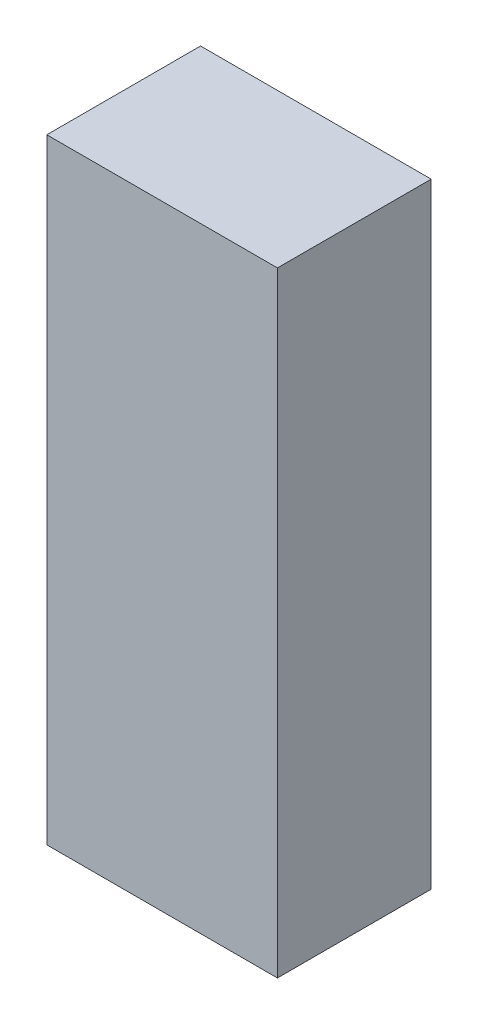
ISO-10303-21;
HEADER;
FILE_DESCRIPTION(('STEP AP214'),'2;1');
FILE_NAME('part.step','',(''),(''),'','','');
FILE_SCHEMA(('AUTOMOTIVE_DESIGN { 1 0 10303 214 1 1 1 1 }'));
ENDSEC;
DATA;
#1=APPLICATION_CONTEXT('core data for automotive mechanical design processes');
#2=APPLICATION_PROTOCOL_DEFINITION('international standard','automotive_design',2000,#1);
#3=PRODUCT_CONTEXT('',#1,'mechanical');
#4=PRODUCT('Part','Part','',(#3));
#5=PRODUCT_RELATED_PRODUCT_CATEGORY('part','',(#4));
#6=PRODUCT_DEFINITION_FORMATION('','',#4);
#7=PRODUCT_DEFINITION_CONTEXT('part definition',#1,'design');
#8=PRODUCT_DEFINITION('design','',#6,#7);
#9=PRODUCT_DEFINITION_SHAPE('','',#8);
#10=(LENGTH_UNIT() NAMED_UNIT(*) SI_UNIT(.MILLI.,.METRE.));
#11=(NAMED_UNIT(*) PLANE_ANGLE_UNIT() SI_UNIT($,.RADIAN.));
#12=(NAMED_UNIT(*) SI_UNIT($,.STERADIAN.) SOLID_ANGLE_UNIT());
#13=UNCERTAINTY_MEASURE_WITH_UNIT(LENGTH_MEASURE(1.E-05),#10,'distance_accuracy_value','');
#14=(GEOMETRIC_REPRESENTATION_CONTEXT(3) GLOBAL_UNCERTAINTY_ASSIGNED_CONTEXT((#13)) GLOBAL_UNIT_ASSIGNED_CONTEXT((#10,
#11,#12)) REPRESENTATION_CONTEXT('',''));
#15=CARTESIAN_POINT('',(0.,0.,0.));
#16=DIRECTION('',(0.,0.,1.));
#17=DIRECTION('',(1.,0.,0.));
#18=AXIS2_PLACEMENT_3D('',#15,#16,#17);
#19=CARTESIAN_POINT('',(-0.1499997,-0.3999992,0.1999996));
#20=DIRECTION('',(0.,0.,-1.));
#21=DIRECTION('',(-1.,0.,0.));
#22=AXIS2_PLACEMENT_3D('',#19,#20,#21);
#23=PLANE('',#22);
#24=DIRECTION('',(0.,1.,0.));
#25=VECTOR('',#24,1.);
#26=CARTESIAN_POINT('',(0.1499997,-0.3999992,0.1999996));
#27=LINE('',#26,#25);
#28=CARTESIAN_POINT('',(0.1499997,-0.3999992,0.1999996));
#29=VERTEX_POINT('',#28);
#30=CARTESIAN_POINT('',(0.1499997,0.3999992,0.1999996));
#31=VERTEX_POINT('',#30);
#32=EDGE_CURVE('E55',#29,#31,#27,.T.);
#33=ORIENTED_EDGE('',*,*,#32,.T.);
#34=DIRECTION('',(1.,0.,0.));
#35=VECTOR('',#34,1.);
#36=CARTESIAN_POINT('',(0.1499997,0.3999992,0.1999996));
#37=LINE('',#36,#35);
#38=CARTESIAN_POINT('',(-0.1499997,0.3999992,0.1999996));
#39=VERTEX_POINT('',#38);
#40=EDGE_CURVE('E57',#31,#39,#37,.F.);
#41=ORIENTED_EDGE('',*,*,#40,.T.);
#42=DIRECTION('',(0.,1.,0.));
#43=VECTOR('',#42,1.);
#44=CARTESIAN_POINT('',(-0.1499997,0.3999992,0.1999996));
#45=LINE('',#44,#43);
#46=CARTESIAN_POINT('',(-0.1499997,-0.3999992,0.1999996));
#47=VERTEX_POINT('',#46);
#48=EDGE_CURVE('E20',#39,#47,#45,.F.);
#49=ORIENTED_EDGE('',*,*,#48,.T.);
#50=DIRECTION('',(1.,0.,0.));
#51=VECTOR('',#50,1.);
#52=CARTESIAN_POINT('',(-0.1499997,-0.3999992,0.1999996));
#53=LINE('',#52,#51);
#54=EDGE_CURVE('E80',#47,#29,#53,.T.);
#55=ORIENTED_EDGE('',*,*,#54,.T.);
#56=EDGE_LOOP('',(#33,#41,#49,#55));
#57=FACE_BOUND('',#56,.T.);
#58=ADVANCED_FACE('F17',(#57),#23,.F.);
#59=CARTESIAN_POINT('',(-0.1499997,0.3999992,0.));
#60=DIRECTION('',(1.,0.,0.));
#61=DIRECTION('',(0.,0.,-1.));
#62=AXIS2_PLACEMENT_3D('',#59,#60,#61);
#63=PLANE('',#62);
#64=DIRECTION('',(0.,0.,1.));
#65=VECTOR('',#64,1.);
#66=CARTESIAN_POINT('',(-0.1499997,-0.3999992,0.));
#67=LINE('',#66,#65);
#68=CARTESIAN_POINT('',(-0.1499997,-0.3999992,0.));
#69=VERTEX_POINT('',#68);
#70=EDGE_CURVE('E68',#69,#47,#67,.T.);
#71=ORIENTED_EDGE('',*,*,#70,.T.);
#72=ORIENTED_EDGE('',*,*,#48,.F.);
#73=DIRECTION('',(0.,0.,-1.));
#74=VECTOR('',#73,1.);
#75=CARTESIAN_POINT('',(-0.1499997,0.3999992,0.));
#76=LINE('',#75,#74);
#77=CARTESIAN_POINT('',(-0.1499997,0.3999992,0.));
#78=VERTEX_POINT('',#77);
#79=EDGE_CURVE('E63',#39,#78,#76,.T.);
#80=ORIENTED_EDGE('',*,*,#79,.T.);
#81=DIRECTION('',(0.,1.,0.));
#82=VECTOR('',#81,1.);
#83=CARTESIAN_POINT('',(-0.1499997,-0.3999992,0.));
#84=LINE('',#83,#82);
#85=EDGE_CURVE('E83',#69,#78,#84,.T.);
#86=ORIENTED_EDGE('',*,*,#85,.F.);
#87=EDGE_LOOP('',(#71,#72,#80,#86));
#88=FACE_BOUND('',#87,.T.);
#89=ADVANCED_FACE('F65',(#88),#63,.F.);
#90=CARTESIAN_POINT('',(0.1499997,0.3999992,0.));
#91=DIRECTION('',(0.,-1.,0.));
#92=DIRECTION('',(0.,0.,-1.));
#93=AXIS2_PLACEMENT_3D('',#90,#91,#92);
#94=PLANE('',#93);
#95=ORIENTED_EDGE('',*,*,#79,.F.);
#96=ORIENTED_EDGE('',*,*,#40,.F.);
#97=DIRECTION('',(0.,0.,1.));
#98=VECTOR('',#97,1.);
#99=CARTESIAN_POINT('',(0.1499997,0.3999992,0.));
#100=LINE('',#99,#98);
#101=CARTESIAN_POINT('',(0.1499997,0.3999992,0.));
#102=VERTEX_POINT('',#101);
#103=EDGE_CURVE('E75',#31,#102,#100,.F.);
#104=ORIENTED_EDGE('',*,*,#103,.T.);
#105=DIRECTION('',(-1.,0.,0.));
#106=VECTOR('',#105,1.);
#107=CARTESIAN_POINT('',(-0.1499997,0.3999992,0.));
#108=LINE('',#107,#106);
#109=EDGE_CURVE('E72',#78,#102,#108,.F.);
#110=ORIENTED_EDGE('',*,*,#109,.F.);
#111=EDGE_LOOP('',(#95,#96,#104,#110));
#112=FACE_BOUND('',#111,.T.);
#113=ADVANCED_FACE('F70',(#112),#94,.F.);
#114=CARTESIAN_POINT('',(0.1499997,-0.3999992,0.));
#115=DIRECTION('',(-1.,0.,0.));
#116=DIRECTION('',(0.,0.,1.));
#117=AXIS2_PLACEMENT_3D('',#114,#115,#116);
#118=PLANE('',#117);
#119=ORIENTED_EDGE('',*,*,#103,.F.);
#120=ORIENTED_EDGE('',*,*,#32,.F.);
#121=DIRECTION('',(0.,0.,1.));
#122=VECTOR('',#121,1.);
#123=CARTESIAN_POINT('',(0.1499997,-0.3999992,0.));
#124=LINE('',#123,#122);
#125=CARTESIAN_POINT('',(0.1499997,-0.3999992,0.));
#126=VERTEX_POINT('',#125);
#127=EDGE_CURVE('E35',#29,#126,#124,.F.);
#128=ORIENTED_EDGE('',*,*,#127,.T.);
#129=DIRECTION('',(0.,1.,0.));
#130=VECTOR('',#129,1.);
#131=CARTESIAN_POINT('',(0.1499997,-0.3999992,0.));
#132=LINE('',#131,#130);
#133=EDGE_CURVE('E26',#102,#126,#132,.F.);
#134=ORIENTED_EDGE('',*,*,#133,.F.);
#135=EDGE_LOOP('',(#119,#120,#128,#134));
#136=FACE_BOUND('',#135,.T.);
#137=ADVANCED_FACE('F89',(#136),#118,.F.);
#138=CARTESIAN_POINT('',(-0.1499997,-0.3999992,0.));
#139=DIRECTION('',(0.,1.,0.));
#140=DIRECTION('',(0.,0.,1.));
#141=AXIS2_PLACEMENT_3D('',#138,#139,#140);
#142=PLANE('',#141);
#143=ORIENTED_EDGE('',*,*,#127,.F.);
#144=ORIENTED_EDGE('',*,*,#54,.F.);
#145=ORIENTED_EDGE('',*,*,#70,.F.);
#146=DIRECTION('',(-1.,0.,0.));
#147=VECTOR('',#146,1.);
#148=CARTESIAN_POINT('',(-0.1499997,-0.3999992,0.));
#149=LINE('',#148,#147);
#150=EDGE_CURVE('E11',#126,#69,#149,.T.);
#151=ORIENTED_EDGE('',*,*,#150,.F.);
#152=EDGE_LOOP('',(#143,#144,#145,#151));
#153=FACE_BOUND('',#152,.T.);
#154=ADVANCED_FACE('F91',(#153),#142,.F.);
#155=CARTESIAN_POINT('',(-0.1499997,-0.3999992,0.));
#156=DIRECTION('',(0.,0.,-1.));
#157=DIRECTION('',(-1.,0.,0.));
#158=AXIS2_PLACEMENT_3D('',#155,#156,#157);
#159=PLANE('',#158);
#160=ORIENTED_EDGE('',*,*,#133,.T.);
#161=ORIENTED_EDGE('',*,*,#150,.T.);
#162=ORIENTED_EDGE('',*,*,#85,.T.);
#163=ORIENTED_EDGE('',*,*,#109,.T.);
#164=EDGE_LOOP('',(#160,#161,#162,#163));
#165=FACE_BOUND('',#164,.T.);
#166=ADVANCED_FACE('F88',(#165),#159,.T.);
#167=CLOSED_SHELL('',(#58,#89,#113,#137,#154,#166));
#168=MANIFOLD_SOLID_BREP('B1',#167);
#169=ADVANCED_BREP_SHAPE_REPRESENTATION('',(#18,#168),#14);
#170=SHAPE_DEFINITION_REPRESENTATION(#9,#169);
ENDSEC;
END-ISO-10303-21;
